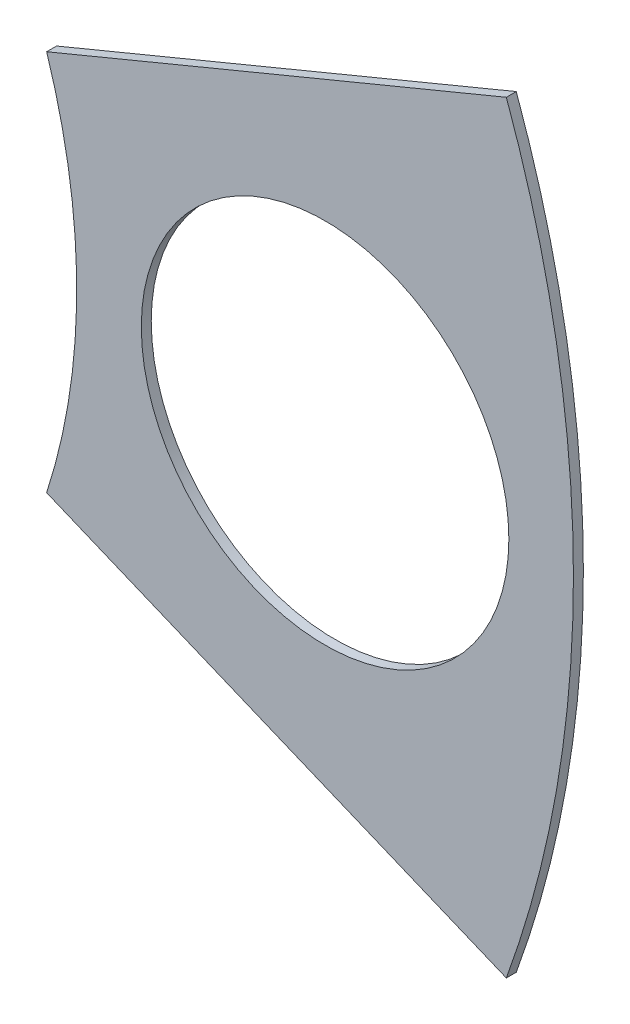
ISO-10303-21;
HEADER;
FILE_DESCRIPTION(('STEP AP214'),'2;1');
FILE_NAME('part.step','',(''),(''),'','','');
FILE_SCHEMA(('AUTOMOTIVE_DESIGN { 1 0 10303 214 1 1 1 1 }'));
ENDSEC;
DATA;
#1=APPLICATION_CONTEXT('core data for automotive mechanical design processes');
#2=APPLICATION_PROTOCOL_DEFINITION('international standard','automotive_design',2000,#1);
#3=PRODUCT_CONTEXT('',#1,'mechanical');
#4=PRODUCT('Part','Part','',(#3));
#5=PRODUCT_RELATED_PRODUCT_CATEGORY('part','',(#4));
#6=PRODUCT_DEFINITION_FORMATION('','',#4);
#7=PRODUCT_DEFINITION_CONTEXT('part definition',#1,'design');
#8=PRODUCT_DEFINITION('design','',#6,#7);
#9=PRODUCT_DEFINITION_SHAPE('','',#8);
#10=(LENGTH_UNIT() NAMED_UNIT(*) SI_UNIT(.MILLI.,.METRE.));
#11=(NAMED_UNIT(*) PLANE_ANGLE_UNIT() SI_UNIT($,.RADIAN.));
#12=(NAMED_UNIT(*) SI_UNIT($,.STERADIAN.) SOLID_ANGLE_UNIT());
#13=UNCERTAINTY_MEASURE_WITH_UNIT(LENGTH_MEASURE(1.E-05),#10,'distance_accuracy_value','');
#14=(GEOMETRIC_REPRESENTATION_CONTEXT(3) GLOBAL_UNCERTAINTY_ASSIGNED_CONTEXT((#13)) GLOBAL_UNIT_ASSIGNED_CONTEXT((#10,
#11,#12)) REPRESENTATION_CONTEXT('',''));
#15=CARTESIAN_POINT('',(0.,0.,0.));
#16=DIRECTION('',(0.,0.,1.));
#17=DIRECTION('',(1.,0.,0.));
#18=AXIS2_PLACEMENT_3D('',#15,#16,#17);
#19=CARTESIAN_POINT('',(0.,0.,0.254));
#20=DIRECTION('',(0.,0.,-1.));
#21=DIRECTION('',(-1.,0.,0.));
#22=AXIS2_PLACEMENT_3D('',#19,#20,#21);
#23=CYLINDRICAL_SURFACE('',#22,28.575);
#24=DIRECTION('',(0.,0.,1.));
#25=VECTOR('',#24,1.);
#26=CARTESIAN_POINT('',(26.8597787783913,-9.7510465579794,0.));
#27=LINE('',#26,#25);
#28=CARTESIAN_POINT('',(26.8597787783913,-9.7510465579794,0.));
#29=VERTEX_POINT('',#28);
#30=CARTESIAN_POINT('',(26.8597787783913,-9.7510465579794,0.254));
#31=VERTEX_POINT('',#30);
#32=EDGE_CURVE('E90',#29,#31,#27,.T.);
#33=ORIENTED_EDGE('',*,*,#32,.F.);
#34=CARTESIAN_POINT('',(0.,0.,0.));
#35=DIRECTION('',(0.,0.,1.));
#36=DIRECTION('',(1.,0.,0.));
#37=AXIS2_PLACEMENT_3D('',#34,#35,#36);
#38=CIRCLE('',#37,28.575);
#39=CARTESIAN_POINT('',(26.8597787783913,9.75104655797939,0.));
#40=VERTEX_POINT('',#39);
#41=EDGE_CURVE('E36',#29,#40,#38,.T.);
#42=ORIENTED_EDGE('',*,*,#41,.T.);
#43=DIRECTION('',(0.,0.,1.));
#44=VECTOR('',#43,1.);
#45=CARTESIAN_POINT('',(26.8597787783913,9.75104655797939,0.));
#46=LINE('',#45,#44);
#47=CARTESIAN_POINT('',(26.8597787783913,9.75104655797939,0.254));
#48=VERTEX_POINT('',#47);
#49=EDGE_CURVE('E71',#40,#48,#46,.T.);
#50=ORIENTED_EDGE('',*,*,#49,.T.);
#51=CARTESIAN_POINT('',(0.,0.,0.254));
#52=DIRECTION('',(0.,0.,1.));
#53=DIRECTION('',(1.,0.,0.));
#54=AXIS2_PLACEMENT_3D('',#51,#52,#53);
#55=CIRCLE('',#54,28.575);
#56=EDGE_CURVE('E12',#31,#48,#55,.T.);
#57=ORIENTED_EDGE('',*,*,#56,.F.);
#58=EDGE_LOOP('',(#33,#42,#50,#57));
#59=FACE_BOUND('',#58,.T.);
#60=ADVANCED_FACE('F33',(#59),#23,.T.);
#61=CARTESIAN_POINT('',(0.,0.,0.254));
#62=DIRECTION('',(0.,0.,1.));
#63=DIRECTION('',(1.,0.,0.));
#64=AXIS2_PLACEMENT_3D('',#61,#62,#63);
#65=PLANE('',#64);
#66=CARTESIAN_POINT('',(22.225,0.,0.254));
#67=DIRECTION('',(0.,0.,1.));
#68=DIRECTION('',(1.,0.,0.));
#69=AXIS2_PLACEMENT_3D('',#66,#67,#68);
#70=CIRCLE('',#69,4.699);
#71=CARTESIAN_POINT('',(26.924,0.,0.254));
#72=VERTEX_POINT('',#71);
#73=EDGE_CURVE('E97',#72,#72,#70,.T.);
#74=ORIENTED_EDGE('',*,*,#73,.F.);
#75=EDGE_LOOP('',(#74));
#76=FACE_BOUND('',#75,.T.);
#77=CARTESIAN_POINT('',(0.,0.,0.254));
#78=DIRECTION('',(0.,0.,1.));
#79=DIRECTION('',(1.,0.,0.));
#80=AXIS2_PLACEMENT_3D('',#77,#78,#79);
#81=CIRCLE('',#80,15.875);
#82=CARTESIAN_POINT('',(15.1055871232775,-4.88230095969859,0.254));
#83=VERTEX_POINT('',#82);
#84=CARTESIAN_POINT('',(15.1055871232775,4.88230095969859,0.254));
#85=VERTEX_POINT('',#84);
#86=EDGE_CURVE('E91',#83,#85,#81,.T.);
#87=ORIENTED_EDGE('',*,*,#86,.F.);
#88=DIRECTION('',(0.923879532511287,-0.382683432365091,0.));
#89=VECTOR('',#88,1.);
#90=CARTESIAN_POINT('',(15.1055871232775,-4.88230095969859,0.254));
#91=LINE('',#90,#89);
#92=EDGE_CURVE('E47',#83,#31,#91,.T.);
#93=ORIENTED_EDGE('',*,*,#92,.T.);
#94=ORIENTED_EDGE('',*,*,#56,.T.);
#95=DIRECTION('',(-0.923879532511287,-0.38268343236509,0.));
#96=VECTOR('',#95,1.);
#97=CARTESIAN_POINT('',(15.1055871232775,4.88230095969859,0.254));
#98=LINE('',#97,#96);
#99=EDGE_CURVE('E74',#48,#85,#98,.T.);
#100=ORIENTED_EDGE('',*,*,#99,.T.);
#101=EDGE_LOOP('',(#87,#93,#94,#100));
#102=FACE_BOUND('',#101,.T.);
#103=ADVANCED_FACE('F113',(#76,#102),#65,.T.);
#104=CARTESIAN_POINT('',(0.,0.,0.));
#105=DIRECTION('',(0.,0.,1.));
#106=DIRECTION('',(1.,0.,0.));
#107=AXIS2_PLACEMENT_3D('',#104,#105,#106);
#108=PLANE('',#107);
#109=CARTESIAN_POINT('',(22.225,0.,0.));
#110=DIRECTION('',(0.,0.,1.));
#111=DIRECTION('',(1.,0.,0.));
#112=AXIS2_PLACEMENT_3D('',#109,#110,#111);
#113=CIRCLE('',#112,4.699);
#114=CARTESIAN_POINT('',(26.924,0.,0.));
#115=VERTEX_POINT('',#114);
#116=EDGE_CURVE('E94',#115,#115,#113,.T.);
#117=ORIENTED_EDGE('',*,*,#116,.T.);
#118=EDGE_LOOP('',(#117));
#119=FACE_BOUND('',#118,.T.);
#120=DIRECTION('',(0.923879532511287,-0.382683432365091,0.));
#121=VECTOR('',#120,1.);
#122=CARTESIAN_POINT('',(15.1055871232775,-4.88230095969859,0.));
#123=LINE('',#122,#121);
#124=CARTESIAN_POINT('',(15.1055871232775,-4.88230095969859,0.));
#125=VERTEX_POINT('',#124);
#126=EDGE_CURVE('E79',#125,#29,#123,.T.);
#127=ORIENTED_EDGE('',*,*,#126,.F.);
#128=CARTESIAN_POINT('',(0.,0.,0.));
#129=DIRECTION('',(0.,0.,1.));
#130=DIRECTION('',(1.,0.,0.));
#131=AXIS2_PLACEMENT_3D('',#128,#129,#130);
#132=CIRCLE('',#131,15.875);
#133=CARTESIAN_POINT('',(15.1055871232775,4.88230095969859,0.));
#134=VERTEX_POINT('',#133);
#135=EDGE_CURVE('E87',#125,#134,#132,.T.);
#136=ORIENTED_EDGE('',*,*,#135,.T.);
#137=DIRECTION('',(-0.923879532511287,-0.38268343236509,0.));
#138=VECTOR('',#137,1.);
#139=CARTESIAN_POINT('',(15.1055871232775,4.88230095969859,0.));
#140=LINE('',#139,#138);
#141=EDGE_CURVE('E55',#40,#134,#140,.T.);
#142=ORIENTED_EDGE('',*,*,#141,.F.);
#143=ORIENTED_EDGE('',*,*,#41,.F.);
#144=EDGE_LOOP('',(#127,#136,#142,#143));
#145=FACE_BOUND('',#144,.T.);
#146=ADVANCED_FACE('F85',(#119,#145),#108,.F.);
#147=CARTESIAN_POINT('',(0.,0.,0.));
#148=DIRECTION('',(0.,0.,1.));
#149=DIRECTION('',(1.,0.,0.));
#150=AXIS2_PLACEMENT_3D('',#147,#148,#149);
#151=CYLINDRICAL_SURFACE('',#150,15.875);
#152=DIRECTION('',(0.,0.,1.));
#153=VECTOR('',#152,1.);
#154=CARTESIAN_POINT('',(15.1055871232775,-4.88230095969859,0.));
#155=LINE('',#154,#153);
#156=EDGE_CURVE('E103',#125,#83,#155,.T.);
#157=ORIENTED_EDGE('',*,*,#156,.T.);
#158=ORIENTED_EDGE('',*,*,#86,.T.);
#159=DIRECTION('',(0.,0.,1.));
#160=VECTOR('',#159,1.);
#161=CARTESIAN_POINT('',(15.1055871232775,4.88230095969859,0.));
#162=LINE('',#161,#160);
#163=EDGE_CURVE('E78',#134,#85,#162,.T.);
#164=ORIENTED_EDGE('',*,*,#163,.F.);
#165=ORIENTED_EDGE('',*,*,#135,.F.);
#166=EDGE_LOOP('',(#157,#158,#164,#165));
#167=FACE_BOUND('',#166,.T.);
#168=ADVANCED_FACE('F110',(#167),#151,.F.);
#169=CARTESIAN_POINT('',(22.225,0.,0.));
#170=DIRECTION('',(0.,0.,1.));
#171=DIRECTION('',(1.,0.,0.));
#172=AXIS2_PLACEMENT_3D('',#169,#170,#171);
#173=CYLINDRICAL_SURFACE('',#172,4.699);
#174=ORIENTED_EDGE('',*,*,#116,.F.);
#175=EDGE_LOOP('',(#174));
#176=FACE_BOUND('',#175,.T.);
#177=ORIENTED_EDGE('',*,*,#73,.T.);
#178=EDGE_LOOP('',(#177));
#179=FACE_BOUND('',#178,.T.);
#180=ADVANCED_FACE('F126',(#176,#179),#173,.F.);
#181=CARTESIAN_POINT('',(15.1055871232775,4.88230095969859,0.));
#182=DIRECTION('',(-0.38268343236509,0.923879532511287,0.));
#183=DIRECTION('',(-0.923879532511287,-0.38268343236509,0.));
#184=AXIS2_PLACEMENT_3D('',#181,#182,#183);
#185=PLANE('',#184);
#186=ORIENTED_EDGE('',*,*,#99,.F.);
#187=ORIENTED_EDGE('',*,*,#49,.F.);
#188=ORIENTED_EDGE('',*,*,#141,.T.);
#189=ORIENTED_EDGE('',*,*,#163,.T.);
#190=EDGE_LOOP('',(#186,#187,#188,#189));
#191=FACE_BOUND('',#190,.T.);
#192=ADVANCED_FACE('F72',(#191),#185,.T.);
#193=CARTESIAN_POINT('',(15.1055871232775,-4.88230095969859,0.));
#194=DIRECTION('',(-0.38268343236509,-0.923879532511287,0.));
#195=DIRECTION('',(0.923879532511287,-0.38268343236509,0.));
#196=AXIS2_PLACEMENT_3D('',#193,#194,#195);
#197=PLANE('',#196);
#198=ORIENTED_EDGE('',*,*,#92,.F.);
#199=ORIENTED_EDGE('',*,*,#156,.F.);
#200=ORIENTED_EDGE('',*,*,#126,.T.);
#201=ORIENTED_EDGE('',*,*,#32,.T.);
#202=EDGE_LOOP('',(#198,#199,#200,#201));
#203=FACE_BOUND('',#202,.T.);
#204=ADVANCED_FACE('F108',(#203),#197,.T.);
#205=CLOSED_SHELL('',(#60,#103,#146,#168,#180,#192,#204));
#206=MANIFOLD_SOLID_BREP('B2',#205);
#207=ADVANCED_BREP_SHAPE_REPRESENTATION('',(#18,#206),#14);
#208=SHAPE_DEFINITION_REPRESENTATION(#9,#207);
ENDSEC;
END-ISO-10303-21;
